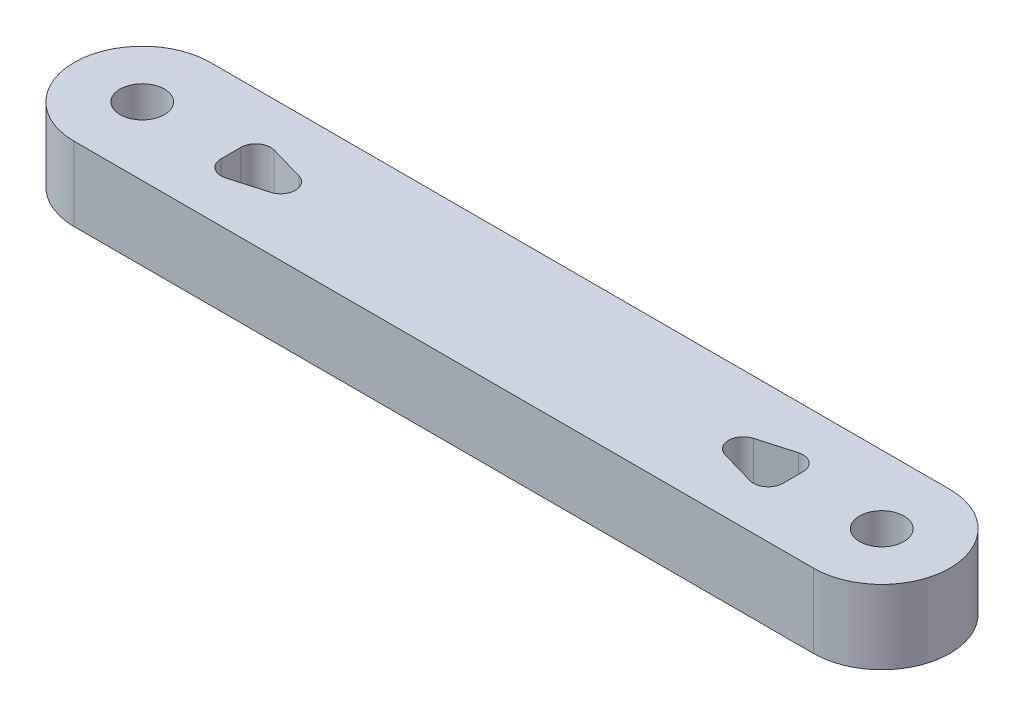
ISO-10303-21;
HEADER;
FILE_DESCRIPTION(('STEP AP214'),'2;1');
FILE_NAME('part.step','',(''),(''),'','','');
FILE_SCHEMA(('AUTOMOTIVE_DESIGN { 1 0 10303 214 1 1 1 1 }'));
ENDSEC;
DATA;
#1=APPLICATION_CONTEXT('core data for automotive mechanical design processes');
#2=APPLICATION_PROTOCOL_DEFINITION('international standard','automotive_design',2000,#1);
#3=PRODUCT_CONTEXT('',#1,'mechanical');
#4=PRODUCT('Part','Part','',(#3));
#5=PRODUCT_RELATED_PRODUCT_CATEGORY('part','',(#4));
#6=PRODUCT_DEFINITION_FORMATION('','',#4);
#7=PRODUCT_DEFINITION_CONTEXT('part definition',#1,'design');
#8=PRODUCT_DEFINITION('design','',#6,#7);
#9=PRODUCT_DEFINITION_SHAPE('','',#8);
#10=(LENGTH_UNIT() NAMED_UNIT(*) SI_UNIT(.MILLI.,.METRE.));
#11=(NAMED_UNIT(*) PLANE_ANGLE_UNIT() SI_UNIT($,.RADIAN.));
#12=(NAMED_UNIT(*) SI_UNIT($,.STERADIAN.) SOLID_ANGLE_UNIT());
#13=UNCERTAINTY_MEASURE_WITH_UNIT(LENGTH_MEASURE(1.E-05),#10,'distance_accuracy_value','');
#14=(GEOMETRIC_REPRESENTATION_CONTEXT(3) GLOBAL_UNCERTAINTY_ASSIGNED_CONTEXT((#13)) GLOBAL_UNIT_ASSIGNED_CONTEXT((#10,
#11,#12)) REPRESENTATION_CONTEXT('',''));
#15=CARTESIAN_POINT('',(0.,0.,0.));
#16=DIRECTION('',(0.,0.,1.));
#17=DIRECTION('',(1.,0.,0.));
#18=AXIS2_PLACEMENT_3D('',#15,#16,#17);
#19=CARTESIAN_POINT('',(50.,5.,0.));
#20=DIRECTION('',(0.,-1.,0.));
#21=DIRECTION('',(0.,0.,1.));
#22=AXIS2_PLACEMENT_3D('',#19,#20,#21);
#23=CYLINDRICAL_SURFACE('',#22,1.5);
#24=CARTESIAN_POINT('',(50.,5.,0.));
#25=DIRECTION('',(0.,-1.,0.));
#26=DIRECTION('',(0.,0.,-1.));
#27=AXIS2_PLACEMENT_3D('',#24,#25,#26);
#28=CIRCLE('',#27,1.5);
#29=CARTESIAN_POINT('',(50.,5.,-1.5));
#30=VERTEX_POINT('',#29);
#31=EDGE_CURVE('E167',#30,#30,#28,.T.);
#32=ORIENTED_EDGE('',*,*,#31,.F.);
#33=EDGE_LOOP('',(#32));
#34=FACE_BOUND('',#33,.T.);
#35=CARTESIAN_POINT('',(50.,0.,0.));
#36=DIRECTION('',(0.,-1.,0.));
#37=DIRECTION('',(0.,0.,-1.));
#38=AXIS2_PLACEMENT_3D('',#35,#36,#37);
#39=CIRCLE('',#38,1.5);
#40=CARTESIAN_POINT('',(50.,0.,-1.5));
#41=VERTEX_POINT('',#40);
#42=EDGE_CURVE('E291',#41,#41,#39,.T.);
#43=ORIENTED_EDGE('',*,*,#42,.T.);
#44=EDGE_LOOP('',(#43));
#45=FACE_BOUND('',#44,.T.);
#46=ADVANCED_FACE('F43',(#34,#45),#23,.F.);
#47=CARTESIAN_POINT('',(0.,0.,0.));
#48=DIRECTION('',(0.,1.,0.));
#49=DIRECTION('',(0.,0.,-1.));
#50=AXIS2_PLACEMENT_3D('',#47,#48,#49);
#51=PLANE('',#50);
#52=DIRECTION('',(0.,0.,-1.));
#53=VECTOR('',#52,1.);
#54=CARTESIAN_POINT('',(6.,0.,0.));
#55=LINE('',#54,#53);
#56=CARTESIAN_POINT('',(6.,0.,0.674270015817069));
#57=VERTEX_POINT('',#56);
#58=CARTESIAN_POINT('',(6.,0.,-0.674270015817069));
#59=VERTEX_POINT('',#58);
#60=EDGE_CURVE('E272',#57,#59,#55,.T.);
#61=ORIENTED_EDGE('',*,*,#60,.F.);
#62=CARTESIAN_POINT('',(7.,0.,0.674270015817069));
#63=DIRECTION('',(0.,-1.,0.));
#64=DIRECTION('',(0.,0.,-1.));
#65=AXIS2_PLACEMENT_3D('',#62,#63,#64);
#66=CIRCLE('',#65,1.);
#67=CARTESIAN_POINT('',(7.27472112789738,0.,1.63579396345789));
#68=VERTEX_POINT('',#67);
#69=EDGE_CURVE('E11',#68,#57,#66,.T.);
#70=ORIENTED_EDGE('',*,*,#69,.F.);
#71=DIRECTION('',(-0.961523947640823,0.,0.274721127897378));
#72=VECTOR('',#71,1.);
#73=CARTESIAN_POINT('',(0.981132075471698,0.,3.43396226415094));
#74=LINE('',#73,#72);
#75=CARTESIAN_POINT('',(9.63466618325712,0.,0.961523947640821));
#76=VERTEX_POINT('',#75);
#77=EDGE_CURVE('E277',#76,#68,#74,.T.);
#78=ORIENTED_EDGE('',*,*,#77,.F.);
#79=CARTESIAN_POINT('',(9.35994505535974,0.,0.));
#80=DIRECTION('',(0.,-1.,0.));
#81=DIRECTION('',(0.,0.,-1.));
#82=AXIS2_PLACEMENT_3D('',#79,#80,#81);
#83=CIRCLE('',#82,1.);
#84=CARTESIAN_POINT('',(9.63466618325712,0.,-0.961523947640821));
#85=VERTEX_POINT('',#84);
#86=EDGE_CURVE('E229',#85,#76,#83,.T.);
#87=ORIENTED_EDGE('',*,*,#86,.F.);
#88=DIRECTION('',(0.961523947640823,0.,0.274721127897378));
#89=VECTOR('',#88,1.);
#90=CARTESIAN_POINT('',(0.981132075471698,0.,-3.43396226415094));
#91=LINE('',#90,#89);
#92=CARTESIAN_POINT('',(7.27472112789738,0.,-1.63579396345789));
#93=VERTEX_POINT('',#92);
#94=EDGE_CURVE('E274',#93,#85,#91,.T.);
#95=ORIENTED_EDGE('',*,*,#94,.F.);
#96=CARTESIAN_POINT('',(7.,0.,-0.674270015817069));
#97=DIRECTION('',(0.,-1.,0.));
#98=DIRECTION('',(0.,0.,-1.));
#99=AXIS2_PLACEMENT_3D('',#96,#97,#98);
#100=CIRCLE('',#99,1.);
#101=EDGE_CURVE('E234',#59,#93,#100,.T.);
#102=ORIENTED_EDGE('',*,*,#101,.F.);
#103=EDGE_LOOP('',(#61,#70,#78,#87,#95,#102));
#104=FACE_BOUND('',#103,.T.);
#105=DIRECTION('',(0.961523947640823,0.,-0.274721127897379));
#106=VECTOR('',#105,1.);
#107=CARTESIAN_POINT('',(2.7924528301887,0.,9.77358490566042));
#108=LINE('',#107,#106);
#109=CARTESIAN_POINT('',(40.3653338167429,0.,-0.961523947640821));
#110=VERTEX_POINT('',#109);
#111=CARTESIAN_POINT('',(42.7252788721026,0.,-1.6357939634579));
#112=VERTEX_POINT('',#111);
#113=EDGE_CURVE('E258',#110,#112,#108,.T.);
#114=ORIENTED_EDGE('',*,*,#113,.F.);
#115=CARTESIAN_POINT('',(40.6400549446403,0.,0.));
#116=DIRECTION('',(0.,-1.,0.));
#117=DIRECTION('',(0.,0.,-1.));
#118=AXIS2_PLACEMENT_3D('',#115,#116,#117);
#119=CIRCLE('',#118,1.);
#120=CARTESIAN_POINT('',(40.3653338167429,0.,0.961523947640829));
#121=VERTEX_POINT('',#120);
#122=EDGE_CURVE('E223',#121,#110,#119,.T.);
#123=ORIENTED_EDGE('',*,*,#122,.F.);
#124=DIRECTION('',(-0.961523947640823,0.,-0.274721127897378));
#125=VECTOR('',#124,1.);
#126=CARTESIAN_POINT('',(2.79245283018868,0.,-9.77358490566038));
#127=LINE('',#126,#125);
#128=CARTESIAN_POINT('',(42.7252788721026,0.,1.6357939634579));
#129=VERTEX_POINT('',#128);
#130=EDGE_CURVE('E269',#129,#121,#127,.T.);
#131=ORIENTED_EDGE('',*,*,#130,.F.);
#132=CARTESIAN_POINT('',(43.,0.,0.674270015817073));
#133=DIRECTION('',(0.,-1.,0.));
#134=DIRECTION('',(0.,0.,-1.));
#135=AXIS2_PLACEMENT_3D('',#132,#133,#134);
#136=CIRCLE('',#135,1.);
#137=CARTESIAN_POINT('',(44.,0.,0.674270015817073));
#138=VERTEX_POINT('',#137);
#139=EDGE_CURVE('E217',#138,#129,#136,.T.);
#140=ORIENTED_EDGE('',*,*,#139,.F.);
#141=DIRECTION('',(0.,0.,1.));
#142=VECTOR('',#141,1.);
#143=CARTESIAN_POINT('',(44.,0.,0.));
#144=LINE('',#143,#142);
#145=CARTESIAN_POINT('',(44.,0.,-0.674270015817072));
#146=VERTEX_POINT('',#145);
#147=EDGE_CURVE('E266',#146,#138,#144,.T.);
#148=ORIENTED_EDGE('',*,*,#147,.F.);
#149=CARTESIAN_POINT('',(43.,0.,-0.674270015817072));
#150=DIRECTION('',(0.,-1.,0.));
#151=DIRECTION('',(0.,0.,-1.));
#152=AXIS2_PLACEMENT_3D('',#149,#150,#151);
#153=CIRCLE('',#152,1.);
#154=EDGE_CURVE('E211',#112,#146,#153,.T.);
#155=ORIENTED_EDGE('',*,*,#154,.F.);
#156=EDGE_LOOP('',(#114,#123,#131,#140,#148,#155));
#157=FACE_BOUND('',#156,.T.);
#158=CARTESIAN_POINT('',(0.,0.,0.));
#159=DIRECTION('',(0.,-1.,0.));
#160=DIRECTION('',(0.,0.,-1.));
#161=AXIS2_PLACEMENT_3D('',#158,#159,#160);
#162=CIRCLE('',#161,1.5);
#163=CARTESIAN_POINT('',(0.,0.,-1.5));
#164=VERTEX_POINT('',#163);
#165=EDGE_CURVE('E279',#164,#164,#162,.T.);
#166=ORIENTED_EDGE('',*,*,#165,.F.);
#167=EDGE_LOOP('',(#166));
#168=FACE_BOUND('',#167,.T.);
#169=ORIENTED_EDGE('',*,*,#42,.F.);
#170=EDGE_LOOP('',(#169));
#171=FACE_BOUND('',#170,.T.);
#172=DIRECTION('',(1.,0.,0.));
#173=VECTOR('',#172,1.);
#174=CARTESIAN_POINT('',(0.,0.,-4.61059088650664));
#175=LINE('',#174,#173);
#176=CARTESIAN_POINT('',(0.,0.,-4.61059088650664));
#177=VERTEX_POINT('',#176);
#178=CARTESIAN_POINT('',(50.,0.,-4.61059088650664));
#179=VERTEX_POINT('',#178);
#180=EDGE_CURVE('E294',#177,#179,#175,.T.);
#181=ORIENTED_EDGE('',*,*,#180,.T.);
#182=CARTESIAN_POINT('',(50.,0.,0.));
#183=DIRECTION('',(0.,-1.,0.));
#184=DIRECTION('',(0.,0.,-1.));
#185=AXIS2_PLACEMENT_3D('',#182,#183,#184);
#186=CIRCLE('',#185,4.61059088650664);
#187=CARTESIAN_POINT('',(50.,0.,4.61059088650664));
#188=VERTEX_POINT('',#187);
#189=EDGE_CURVE('E178',#179,#188,#186,.T.);
#190=ORIENTED_EDGE('',*,*,#189,.T.);
#191=DIRECTION('',(1.,0.,0.));
#192=VECTOR('',#191,1.);
#193=CARTESIAN_POINT('',(0.,0.,4.61059088650664));
#194=LINE('',#193,#192);
#195=CARTESIAN_POINT('',(0.,0.,4.61059088650664));
#196=VERTEX_POINT('',#195);
#197=EDGE_CURVE('E297',#196,#188,#194,.T.);
#198=ORIENTED_EDGE('',*,*,#197,.F.);
#199=CARTESIAN_POINT('',(0.,0.,0.));
#200=DIRECTION('',(0.,-1.,0.));
#201=DIRECTION('',(0.,0.,-1.));
#202=AXIS2_PLACEMENT_3D('',#199,#200,#201);
#203=CIRCLE('',#202,4.61059088650664);
#204=EDGE_CURVE('E283',#196,#177,#203,.T.);
#205=ORIENTED_EDGE('',*,*,#204,.T.);
#206=EDGE_LOOP('',(#181,#190,#198,#205));
#207=FACE_BOUND('',#206,.T.);
#208=ADVANCED_FACE('F310',(#104,#157,#168,#171,#207),#51,.F.);
#209=CARTESIAN_POINT('',(0.,5.,0.));
#210=DIRECTION('',(0.,-1.,0.));
#211=DIRECTION('',(0.,0.,1.));
#212=AXIS2_PLACEMENT_3D('',#209,#210,#211);
#213=CYLINDRICAL_SURFACE('',#212,1.5);
#214=CARTESIAN_POINT('',(0.,5.,0.));
#215=DIRECTION('',(0.,-1.,0.));
#216=DIRECTION('',(0.,0.,-1.));
#217=AXIS2_PLACEMENT_3D('',#214,#215,#216);
#218=CIRCLE('',#217,1.5);
#219=CARTESIAN_POINT('',(0.,5.,-1.5));
#220=VERTEX_POINT('',#219);
#221=EDGE_CURVE('E280',#220,#220,#218,.T.);
#222=ORIENTED_EDGE('',*,*,#221,.F.);
#223=EDGE_LOOP('',(#222));
#224=FACE_BOUND('',#223,.T.);
#225=ORIENTED_EDGE('',*,*,#165,.T.);
#226=EDGE_LOOP('',(#225));
#227=FACE_BOUND('',#226,.T.);
#228=ADVANCED_FACE('F312',(#224,#227),#213,.F.);
#229=CARTESIAN_POINT('',(0.,5.,4.61059088650664));
#230=DIRECTION('',(0.,0.,1.));
#231=DIRECTION('',(-1.,0.,0.));
#232=AXIS2_PLACEMENT_3D('',#229,#230,#231);
#233=PLANE('',#232);
#234=ORIENTED_EDGE('',*,*,#197,.T.);
#235=DIRECTION('',(0.,-1.,0.));
#236=VECTOR('',#235,1.);
#237=CARTESIAN_POINT('',(50.,5.,4.61059088650664));
#238=LINE('',#237,#236);
#239=CARTESIAN_POINT('',(50.,5.,4.61059088650664));
#240=VERTEX_POINT('',#239);
#241=EDGE_CURVE('E181',#240,#188,#238,.T.);
#242=ORIENTED_EDGE('',*,*,#241,.F.);
#243=DIRECTION('',(1.,0.,0.));
#244=VECTOR('',#243,1.);
#245=CARTESIAN_POINT('',(0.,5.,4.61059088650664));
#246=LINE('',#245,#244);
#247=CARTESIAN_POINT('',(0.,5.,4.61059088650664));
#248=VERTEX_POINT('',#247);
#249=EDGE_CURVE('E172',#248,#240,#246,.T.);
#250=ORIENTED_EDGE('',*,*,#249,.F.);
#251=DIRECTION('',(0.,-1.,0.));
#252=VECTOR('',#251,1.);
#253=CARTESIAN_POINT('',(0.,5.,4.61059088650664));
#254=LINE('',#253,#252);
#255=EDGE_CURVE('E185',#248,#196,#254,.T.);
#256=ORIENTED_EDGE('',*,*,#255,.T.);
#257=EDGE_LOOP('',(#234,#242,#250,#256));
#258=FACE_BOUND('',#257,.T.);
#259=ADVANCED_FACE('F305',(#258),#233,.T.);
#260=CARTESIAN_POINT('',(50.,5.,0.));
#261=DIRECTION('',(0.,-1.,0.));
#262=DIRECTION('',(0.,0.,1.));
#263=AXIS2_PLACEMENT_3D('',#260,#261,#262);
#264=CYLINDRICAL_SURFACE('',#263,4.61059088650664);
#265=ORIENTED_EDGE('',*,*,#189,.F.);
#266=DIRECTION('',(0.,-1.,0.));
#267=VECTOR('',#266,1.);
#268=CARTESIAN_POINT('',(50.,5.,-4.61059088650664));
#269=LINE('',#268,#267);
#270=CARTESIAN_POINT('',(50.,5.,-4.61059088650664));
#271=VERTEX_POINT('',#270);
#272=EDGE_CURVE('E162',#271,#179,#269,.T.);
#273=ORIENTED_EDGE('',*,*,#272,.F.);
#274=CARTESIAN_POINT('',(50.,5.,0.));
#275=DIRECTION('',(0.,-1.,0.));
#276=DIRECTION('',(0.,0.,-1.));
#277=AXIS2_PLACEMENT_3D('',#274,#275,#276);
#278=CIRCLE('',#277,4.61059088650664);
#279=EDGE_CURVE('E166',#271,#240,#278,.T.);
#280=ORIENTED_EDGE('',*,*,#279,.T.);
#281=ORIENTED_EDGE('',*,*,#241,.T.);
#282=EDGE_LOOP('',(#265,#273,#280,#281));
#283=FACE_BOUND('',#282,.T.);
#284=ADVANCED_FACE('F176',(#283),#264,.T.);
#285=CARTESIAN_POINT('',(0.,5.,-4.61059088650664));
#286=DIRECTION('',(0.,0.,1.));
#287=DIRECTION('',(-1.,0.,0.));
#288=AXIS2_PLACEMENT_3D('',#285,#286,#287);
#289=PLANE('',#288);
#290=ORIENTED_EDGE('',*,*,#180,.F.);
#291=DIRECTION('',(0.,-1.,0.));
#292=VECTOR('',#291,1.);
#293=CARTESIAN_POINT('',(0.,5.,-4.61059088650664));
#294=LINE('',#293,#292);
#295=CARTESIAN_POINT('',(0.,5.,-4.61059088650664));
#296=VERTEX_POINT('',#295);
#297=EDGE_CURVE('E164',#296,#177,#294,.T.);
#298=ORIENTED_EDGE('',*,*,#297,.F.);
#299=DIRECTION('',(1.,0.,0.));
#300=VECTOR('',#299,1.);
#301=CARTESIAN_POINT('',(0.,5.,-4.61059088650664));
#302=LINE('',#301,#300);
#303=EDGE_CURVE('E157',#296,#271,#302,.T.);
#304=ORIENTED_EDGE('',*,*,#303,.T.);
#305=ORIENTED_EDGE('',*,*,#272,.T.);
#306=EDGE_LOOP('',(#290,#298,#304,#305));
#307=FACE_BOUND('',#306,.T.);
#308=ADVANCED_FACE('F160',(#307),#289,.F.);
#309=CARTESIAN_POINT('',(0.,5.,0.));
#310=DIRECTION('',(0.,-1.,0.));
#311=DIRECTION('',(0.,0.,1.));
#312=AXIS2_PLACEMENT_3D('',#309,#310,#311);
#313=CYLINDRICAL_SURFACE('',#312,4.61059088650664);
#314=ORIENTED_EDGE('',*,*,#204,.F.);
#315=ORIENTED_EDGE('',*,*,#255,.F.);
#316=CARTESIAN_POINT('',(0.,5.,0.));
#317=DIRECTION('',(0.,-1.,0.));
#318=DIRECTION('',(0.,0.,-1.));
#319=AXIS2_PLACEMENT_3D('',#316,#317,#318);
#320=CIRCLE('',#319,4.61059088650664);
#321=EDGE_CURVE('E287',#248,#296,#320,.T.);
#322=ORIENTED_EDGE('',*,*,#321,.T.);
#323=ORIENTED_EDGE('',*,*,#297,.T.);
#324=EDGE_LOOP('',(#314,#315,#322,#323));
#325=FACE_BOUND('',#324,.T.);
#326=ADVANCED_FACE('F308',(#325),#313,.T.);
#327=CARTESIAN_POINT('',(0.,5.,0.));
#328=DIRECTION('',(0.,1.,0.));
#329=DIRECTION('',(0.,0.,-1.));
#330=AXIS2_PLACEMENT_3D('',#327,#328,#329);
#331=PLANE('',#330);
#332=DIRECTION('',(-0.961523947640823,0.,0.274721127897378));
#333=VECTOR('',#332,1.);
#334=CARTESIAN_POINT('',(6.,5.,2.));
#335=LINE('',#334,#333);
#336=CARTESIAN_POINT('',(9.63466618325712,5.,0.961523947640822));
#337=VERTEX_POINT('',#336);
#338=CARTESIAN_POINT('',(7.27472112789738,5.,1.63579396345789));
#339=VERTEX_POINT('',#338);
#340=EDGE_CURVE('E244',#337,#339,#335,.T.);
#341=ORIENTED_EDGE('',*,*,#340,.T.);
#342=CARTESIAN_POINT('',(7.,5.,0.674270015817069));
#343=DIRECTION('',(0.,-1.,0.));
#344=DIRECTION('',(0.,0.,-1.));
#345=AXIS2_PLACEMENT_3D('',#342,#343,#344);
#346=CIRCLE('',#345,1.);
#347=CARTESIAN_POINT('',(6.,5.,0.674270015817069));
#348=VERTEX_POINT('',#347);
#349=EDGE_CURVE('E51',#348,#339,#346,.F.);
#350=ORIENTED_EDGE('',*,*,#349,.F.);
#351=DIRECTION('',(0.,0.,-1.));
#352=VECTOR('',#351,1.);
#353=CARTESIAN_POINT('',(6.,5.,2.));
#354=LINE('',#353,#352);
#355=CARTESIAN_POINT('',(6.,5.,-0.674270015817069));
#356=VERTEX_POINT('',#355);
#357=EDGE_CURVE('E248',#348,#356,#354,.T.);
#358=ORIENTED_EDGE('',*,*,#357,.T.);
#359=CARTESIAN_POINT('',(7.,5.,-0.674270015817069));
#360=DIRECTION('',(0.,-1.,0.));
#361=DIRECTION('',(0.,0.,-1.));
#362=AXIS2_PLACEMENT_3D('',#359,#360,#361);
#363=CIRCLE('',#362,1.);
#364=CARTESIAN_POINT('',(7.27472112789738,5.,-1.63579396345789));
#365=VERTEX_POINT('',#364);
#366=EDGE_CURVE('E232',#365,#356,#363,.F.);
#367=ORIENTED_EDGE('',*,*,#366,.F.);
#368=DIRECTION('',(0.961523947640823,0.,0.274721127897378));
#369=VECTOR('',#368,1.);
#370=CARTESIAN_POINT('',(6.,5.,-2.));
#371=LINE('',#370,#369);
#372=CARTESIAN_POINT('',(9.63466618325712,5.,-0.961523947640822));
#373=VERTEX_POINT('',#372);
#374=EDGE_CURVE('E251',#365,#373,#371,.T.);
#375=ORIENTED_EDGE('',*,*,#374,.T.);
#376=CARTESIAN_POINT('',(9.35994505535974,5.,0.));
#377=DIRECTION('',(0.,-1.,0.));
#378=DIRECTION('',(0.,0.,-1.));
#379=AXIS2_PLACEMENT_3D('',#376,#377,#378);
#380=CIRCLE('',#379,1.);
#381=EDGE_CURVE('E226',#337,#373,#380,.F.);
#382=ORIENTED_EDGE('',*,*,#381,.F.);
#383=EDGE_LOOP('',(#341,#350,#358,#367,#375,#382));
#384=FACE_BOUND('',#383,.T.);
#385=DIRECTION('',(-0.961523947640823,0.,-0.274721127897378));
#386=VECTOR('',#385,1.);
#387=CARTESIAN_POINT('',(44.,5.,2.));
#388=LINE('',#387,#386);
#389=CARTESIAN_POINT('',(42.7252788721026,5.,1.6357939634579));
#390=VERTEX_POINT('',#389);
#391=CARTESIAN_POINT('',(40.3653338167429,5.,0.961523947640825));
#392=VERTEX_POINT('',#391);
#393=EDGE_CURVE('E249',#390,#392,#388,.T.);
#394=ORIENTED_EDGE('',*,*,#393,.T.);
#395=CARTESIAN_POINT('',(40.6400549446403,5.,0.));
#396=DIRECTION('',(0.,-1.,0.));
#397=DIRECTION('',(0.,0.,-1.));
#398=AXIS2_PLACEMENT_3D('',#395,#396,#397);
#399=CIRCLE('',#398,1.);
#400=CARTESIAN_POINT('',(40.3653338167429,5.,-0.961523947640822));
#401=VERTEX_POINT('',#400);
#402=EDGE_CURVE('E220',#401,#392,#399,.F.);
#403=ORIENTED_EDGE('',*,*,#402,.F.);
#404=DIRECTION('',(0.961523947640823,0.,-0.274721127897379));
#405=VECTOR('',#404,1.);
#406=CARTESIAN_POINT('',(44.,5.,-2.));
#407=LINE('',#406,#405);
#408=CARTESIAN_POINT('',(42.7252788721026,5.,-1.6357939634579));
#409=VERTEX_POINT('',#408);
#410=EDGE_CURVE('E254',#401,#409,#407,.T.);
#411=ORIENTED_EDGE('',*,*,#410,.T.);
#412=CARTESIAN_POINT('',(43.,5.,-0.674270015817072));
#413=DIRECTION('',(0.,-1.,0.));
#414=DIRECTION('',(0.,0.,-1.));
#415=AXIS2_PLACEMENT_3D('',#412,#413,#414);
#416=CIRCLE('',#415,1.);
#417=CARTESIAN_POINT('',(44.,5.,-0.674270015817072));
#418=VERTEX_POINT('',#417);
#419=EDGE_CURVE('E208',#418,#409,#416,.F.);
#420=ORIENTED_EDGE('',*,*,#419,.F.);
#421=DIRECTION('',(0.,0.,1.));
#422=VECTOR('',#421,1.);
#423=CARTESIAN_POINT('',(44.,5.,2.));
#424=LINE('',#423,#422);
#425=CARTESIAN_POINT('',(44.,5.,0.674270015817073));
#426=VERTEX_POINT('',#425);
#427=EDGE_CURVE('E259',#418,#426,#424,.T.);
#428=ORIENTED_EDGE('',*,*,#427,.T.);
#429=CARTESIAN_POINT('',(43.,5.,0.674270015817073));
#430=DIRECTION('',(0.,-1.,0.));
#431=DIRECTION('',(0.,0.,-1.));
#432=AXIS2_PLACEMENT_3D('',#429,#430,#431);
#433=CIRCLE('',#432,1.);
#434=EDGE_CURVE('E214',#390,#426,#433,.F.);
#435=ORIENTED_EDGE('',*,*,#434,.F.);
#436=EDGE_LOOP('',(#394,#403,#411,#420,#428,#435));
#437=FACE_BOUND('',#436,.T.);
#438=ORIENTED_EDGE('',*,*,#221,.T.);
#439=EDGE_LOOP('',(#438));
#440=FACE_BOUND('',#439,.T.);
#441=ORIENTED_EDGE('',*,*,#31,.T.);
#442=EDGE_LOOP('',(#441));
#443=FACE_BOUND('',#442,.T.);
#444=ORIENTED_EDGE('',*,*,#303,.F.);
#445=ORIENTED_EDGE('',*,*,#321,.F.);
#446=ORIENTED_EDGE('',*,*,#249,.T.);
#447=ORIENTED_EDGE('',*,*,#279,.F.);
#448=EDGE_LOOP('',(#444,#445,#446,#447));
#449=FACE_BOUND('',#448,.T.);
#450=ADVANCED_FACE('F170',(#384,#437,#440,#443,#449),#331,.T.);
#451=CARTESIAN_POINT('',(44.,-12.,2.));
#452=DIRECTION('',(-0.274721127897378,0.,0.961523947640823));
#453=DIRECTION('',(-0.961523947640823,0.,-0.274721127897378));
#454=AXIS2_PLACEMENT_3D('',#451,#452,#453);
#455=PLANE('',#454);
#456=ORIENTED_EDGE('',*,*,#130,.T.);
#457=DIRECTION('',(0.,1.,0.));
#458=VECTOR('',#457,1.);
#459=CARTESIAN_POINT('',(40.3653338167429,0.,0.961523947640825));
#460=LINE('',#459,#458);
#461=EDGE_CURVE('E194',#392,#121,#460,.F.);
#462=ORIENTED_EDGE('',*,*,#461,.F.);
#463=ORIENTED_EDGE('',*,*,#393,.F.);
#464=DIRECTION('',(0.,1.,0.));
#465=VECTOR('',#464,1.);
#466=CARTESIAN_POINT('',(42.7252788721026,4.99999999999999,1.6357939634579));
#467=LINE('',#466,#465);
#468=EDGE_CURVE('E196',#129,#390,#467,.T.);
#469=ORIENTED_EDGE('',*,*,#468,.F.);
#470=EDGE_LOOP('',(#456,#462,#463,#469));
#471=FACE_BOUND('',#470,.T.);
#472=ADVANCED_FACE('F379',(#471),#455,.F.);
#473=CARTESIAN_POINT('',(44.,-12.,2.));
#474=DIRECTION('',(1.,0.,0.));
#475=DIRECTION('',(0.,0.,1.));
#476=AXIS2_PLACEMENT_3D('',#473,#474,#475);
#477=PLANE('',#476);
#478=ORIENTED_EDGE('',*,*,#147,.T.);
#479=DIRECTION('',(0.,1.,0.));
#480=VECTOR('',#479,1.);
#481=CARTESIAN_POINT('',(44.,0.,0.674270015817073));
#482=LINE('',#481,#480);
#483=EDGE_CURVE('E180',#426,#138,#482,.F.);
#484=ORIENTED_EDGE('',*,*,#483,.F.);
#485=ORIENTED_EDGE('',*,*,#427,.F.);
#486=DIRECTION('',(0.,1.,0.));
#487=VECTOR('',#486,1.);
#488=CARTESIAN_POINT('',(44.,5.,-0.674270015817072));
#489=LINE('',#488,#487);
#490=EDGE_CURVE('E183',#146,#418,#489,.T.);
#491=ORIENTED_EDGE('',*,*,#490,.F.);
#492=EDGE_LOOP('',(#478,#484,#485,#491));
#493=FACE_BOUND('',#492,.T.);
#494=ADVANCED_FACE('F374',(#493),#477,.F.);
#495=CARTESIAN_POINT('',(44.,-12.,-2.));
#496=DIRECTION('',(-0.274721127897379,0.,-0.961523947640823));
#497=DIRECTION('',(0.961523947640823,0.,-0.274721127897379));
#498=AXIS2_PLACEMENT_3D('',#495,#496,#497);
#499=PLANE('',#498);
#500=ORIENTED_EDGE('',*,*,#410,.F.);
#501=DIRECTION('',(0.,1.,0.));
#502=VECTOR('',#501,1.);
#503=CARTESIAN_POINT('',(40.3653338167429,5.,-0.961523947640821));
#504=LINE('',#503,#502);
#505=EDGE_CURVE('E190',#110,#401,#504,.T.);
#506=ORIENTED_EDGE('',*,*,#505,.F.);
#507=ORIENTED_EDGE('',*,*,#113,.T.);
#508=DIRECTION('',(0.,1.,0.));
#509=VECTOR('',#508,1.);
#510=CARTESIAN_POINT('',(42.7252788721026,0.,-1.63579396345789));
#511=LINE('',#510,#509);
#512=EDGE_CURVE('E192',#409,#112,#511,.F.);
#513=ORIENTED_EDGE('',*,*,#512,.F.);
#514=EDGE_LOOP('',(#500,#506,#507,#513));
#515=FACE_BOUND('',#514,.T.);
#516=ADVANCED_FACE('F367',(#515),#499,.F.);
#517=CARTESIAN_POINT('',(6.,-12.,2.));
#518=DIRECTION('',(0.274721127897378,0.,0.961523947640823));
#519=DIRECTION('',(-0.961523947640823,0.,0.274721127897378));
#520=AXIS2_PLACEMENT_3D('',#517,#518,#519);
#521=PLANE('',#520);
#522=ORIENTED_EDGE('',*,*,#77,.T.);
#523=DIRECTION('',(0.,1.,0.));
#524=VECTOR('',#523,1.);
#525=CARTESIAN_POINT('',(7.27472112789738,0.,1.63579396345789));
#526=LINE('',#525,#524);
#527=EDGE_CURVE('E198',#339,#68,#526,.F.);
#528=ORIENTED_EDGE('',*,*,#527,.F.);
#529=ORIENTED_EDGE('',*,*,#340,.F.);
#530=DIRECTION('',(0.,1.,0.));
#531=VECTOR('',#530,1.);
#532=CARTESIAN_POINT('',(9.63466618325712,5.,0.961523947640823));
#533=LINE('',#532,#531);
#534=EDGE_CURVE('E200',#76,#337,#533,.T.);
#535=ORIENTED_EDGE('',*,*,#534,.F.);
#536=EDGE_LOOP('',(#522,#528,#529,#535));
#537=FACE_BOUND('',#536,.T.);
#538=ADVANCED_FACE('F365',(#537),#521,.F.);
#539=CARTESIAN_POINT('',(6.,-12.,-2.));
#540=DIRECTION('',(0.274721127897378,0.,-0.961523947640823));
#541=DIRECTION('',(0.961523947640823,0.,0.274721127897378));
#542=AXIS2_PLACEMENT_3D('',#539,#540,#541);
#543=PLANE('',#542);
#544=ORIENTED_EDGE('',*,*,#374,.F.);
#545=DIRECTION('',(0.,1.,0.));
#546=VECTOR('',#545,1.);
#547=CARTESIAN_POINT('',(7.27472112789738,4.99999999999999,-1.63579396345789));
#548=LINE('',#547,#546);
#549=EDGE_CURVE('E202',#93,#365,#548,.T.);
#550=ORIENTED_EDGE('',*,*,#549,.F.);
#551=ORIENTED_EDGE('',*,*,#94,.T.);
#552=DIRECTION('',(0.,1.,0.));
#553=VECTOR('',#552,1.);
#554=CARTESIAN_POINT('',(9.63466618325712,0.,-0.961523947640823));
#555=LINE('',#554,#553);
#556=EDGE_CURVE('E204',#373,#85,#555,.F.);
#557=ORIENTED_EDGE('',*,*,#556,.F.);
#558=EDGE_LOOP('',(#544,#550,#551,#557));
#559=FACE_BOUND('',#558,.T.);
#560=ADVANCED_FACE('F362',(#559),#543,.F.);
#561=CARTESIAN_POINT('',(6.,-12.,2.));
#562=DIRECTION('',(-1.,0.,0.));
#563=DIRECTION('',(0.,0.,-1.));
#564=AXIS2_PLACEMENT_3D('',#561,#562,#563);
#565=PLANE('',#564);
#566=ORIENTED_EDGE('',*,*,#357,.F.);
#567=DIRECTION('',(0.,1.,0.));
#568=VECTOR('',#567,1.);
#569=CARTESIAN_POINT('',(6.,4.99999999999999,0.674270015817069));
#570=LINE('',#569,#568);
#571=EDGE_CURVE('E66',#57,#348,#570,.T.);
#572=ORIENTED_EDGE('',*,*,#571,.F.);
#573=ORIENTED_EDGE('',*,*,#60,.T.);
#574=DIRECTION('',(0.,1.,0.));
#575=VECTOR('',#574,1.);
#576=CARTESIAN_POINT('',(6.,0.,-0.674270015817069));
#577=LINE('',#576,#575);
#578=EDGE_CURVE('E58',#356,#59,#577,.F.);
#579=ORIENTED_EDGE('',*,*,#578,.F.);
#580=EDGE_LOOP('',(#566,#572,#573,#579));
#581=FACE_BOUND('',#580,.T.);
#582=ADVANCED_FACE('F340',(#581),#565,.F.);
#583=CARTESIAN_POINT('',(43.,-12.,-0.674270015817072));
#584=DIRECTION('',(0.,-1.,0.));
#585=DIRECTION('',(0.,0.,1.));
#586=AXIS2_PLACEMENT_3D('',#583,#584,#585);
#587=CYLINDRICAL_SURFACE('',#586,1.);
#588=ORIENTED_EDGE('',*,*,#154,.T.);
#589=ORIENTED_EDGE('',*,*,#490,.T.);
#590=ORIENTED_EDGE('',*,*,#419,.T.);
#591=ORIENTED_EDGE('',*,*,#512,.T.);
#592=EDGE_LOOP('',(#588,#589,#590,#591));
#593=FACE_BOUND('',#592,.T.);
#594=ADVANCED_FACE('F336',(#593),#587,.F.);
#595=CARTESIAN_POINT('',(43.,-12.,0.674270015817073));
#596=DIRECTION('',(0.,-1.,0.));
#597=DIRECTION('',(0.,0.,1.));
#598=AXIS2_PLACEMENT_3D('',#595,#596,#597);
#599=CYLINDRICAL_SURFACE('',#598,1.);
#600=ORIENTED_EDGE('',*,*,#139,.T.);
#601=ORIENTED_EDGE('',*,*,#468,.T.);
#602=ORIENTED_EDGE('',*,*,#434,.T.);
#603=ORIENTED_EDGE('',*,*,#483,.T.);
#604=EDGE_LOOP('',(#600,#601,#602,#603));
#605=FACE_BOUND('',#604,.T.);
#606=ADVANCED_FACE('F339',(#605),#599,.F.);
#607=CARTESIAN_POINT('',(40.6400549446403,-12.,0.));
#608=DIRECTION('',(0.,-1.,0.));
#609=DIRECTION('',(0.,0.,1.));
#610=AXIS2_PLACEMENT_3D('',#607,#608,#609);
#611=CYLINDRICAL_SURFACE('',#610,1.);
#612=ORIENTED_EDGE('',*,*,#122,.T.);
#613=ORIENTED_EDGE('',*,*,#505,.T.);
#614=ORIENTED_EDGE('',*,*,#402,.T.);
#615=ORIENTED_EDGE('',*,*,#461,.T.);
#616=EDGE_LOOP('',(#612,#613,#614,#615));
#617=FACE_BOUND('',#616,.T.);
#618=ADVANCED_FACE('F344',(#617),#611,.F.);
#619=CARTESIAN_POINT('',(9.35994505535974,-12.,0.));
#620=DIRECTION('',(0.,-1.,0.));
#621=DIRECTION('',(0.,0.,1.));
#622=AXIS2_PLACEMENT_3D('',#619,#620,#621);
#623=CYLINDRICAL_SURFACE('',#622,1.);
#624=ORIENTED_EDGE('',*,*,#86,.T.);
#625=ORIENTED_EDGE('',*,*,#534,.T.);
#626=ORIENTED_EDGE('',*,*,#381,.T.);
#627=ORIENTED_EDGE('',*,*,#556,.T.);
#628=EDGE_LOOP('',(#624,#625,#626,#627));
#629=FACE_BOUND('',#628,.T.);
#630=ADVANCED_FACE('F348',(#629),#623,.F.);
#631=CARTESIAN_POINT('',(7.,-12.,-0.674270015817069));
#632=DIRECTION('',(0.,-1.,0.));
#633=DIRECTION('',(0.,0.,1.));
#634=AXIS2_PLACEMENT_3D('',#631,#632,#633);
#635=CYLINDRICAL_SURFACE('',#634,1.);
#636=ORIENTED_EDGE('',*,*,#101,.T.);
#637=ORIENTED_EDGE('',*,*,#549,.T.);
#638=ORIENTED_EDGE('',*,*,#366,.T.);
#639=ORIENTED_EDGE('',*,*,#578,.T.);
#640=EDGE_LOOP('',(#636,#637,#638,#639));
#641=FACE_BOUND('',#640,.T.);
#642=ADVANCED_FACE('F351',(#641),#635,.F.);
#643=CARTESIAN_POINT('',(7.,-12.,0.674270015817069));
#644=DIRECTION('',(0.,-1.,0.));
#645=DIRECTION('',(0.,0.,1.));
#646=AXIS2_PLACEMENT_3D('',#643,#644,#645);
#647=CYLINDRICAL_SURFACE('',#646,1.);
#648=ORIENTED_EDGE('',*,*,#69,.T.);
#649=ORIENTED_EDGE('',*,*,#571,.T.);
#650=ORIENTED_EDGE('',*,*,#349,.T.);
#651=ORIENTED_EDGE('',*,*,#527,.T.);
#652=EDGE_LOOP('',(#648,#649,#650,#651));
#653=FACE_BOUND('',#652,.T.);
#654=ADVANCED_FACE('F45',(#653),#647,.F.);
#655=CLOSED_SHELL('',(#46,#208,#228,#259,#284,#308,#326,#450,#472,#494,#516,#538,#560,#582,#594,
#606,#618,#630,#642,#654));
#656=MANIFOLD_SOLID_BREP('B2',#655);
#657=ADVANCED_BREP_SHAPE_REPRESENTATION('',(#18,#656),#14);
#658=SHAPE_DEFINITION_REPRESENTATION(#9,#657);
ENDSEC;
END-ISO-10303-21;
